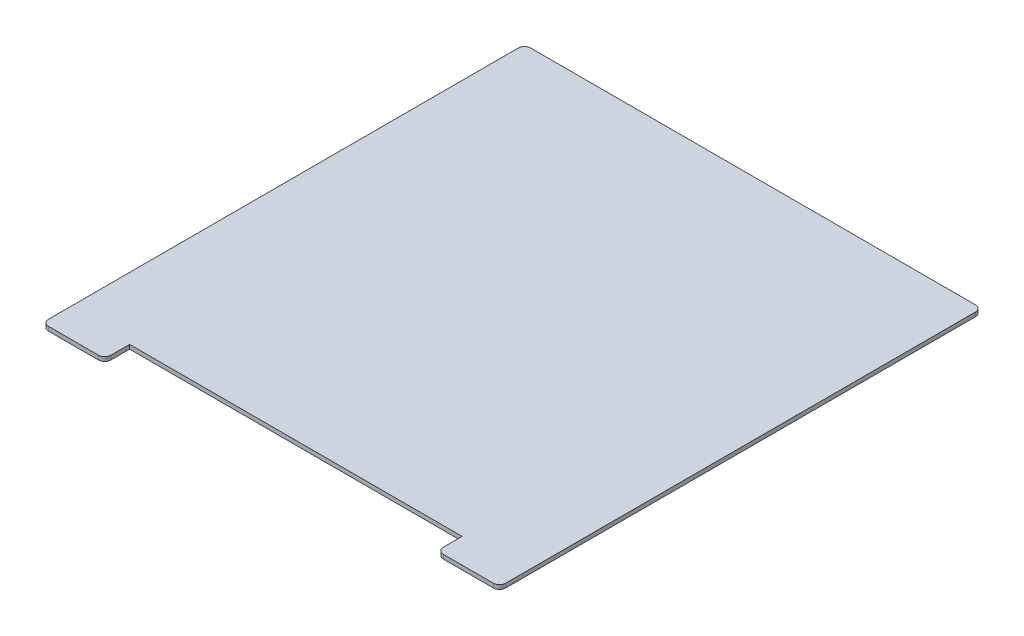
ISO-10303-21;
HEADER;
FILE_DESCRIPTION(('STEP AP214'),'2;1');
FILE_NAME('part.step','',(''),(''),'','','');
FILE_SCHEMA(('AUTOMOTIVE_DESIGN { 1 0 10303 214 1 1 1 1 }'));
ENDSEC;
DATA;
#1=APPLICATION_CONTEXT('core data for automotive mechanical design processes');
#2=APPLICATION_PROTOCOL_DEFINITION('international standard','automotive_design',2000,#1);
#3=PRODUCT_CONTEXT('',#1,'mechanical');
#4=PRODUCT('Part','Part','',(#3));
#5=PRODUCT_RELATED_PRODUCT_CATEGORY('part','',(#4));
#6=PRODUCT_DEFINITION_FORMATION('','',#4);
#7=PRODUCT_DEFINITION_CONTEXT('part definition',#1,'design');
#8=PRODUCT_DEFINITION('design','',#6,#7);
#9=PRODUCT_DEFINITION_SHAPE('','',#8);
#10=(LENGTH_UNIT() NAMED_UNIT(*) SI_UNIT(.MILLI.,.METRE.));
#11=(NAMED_UNIT(*) PLANE_ANGLE_UNIT() SI_UNIT($,.RADIAN.));
#12=(NAMED_UNIT(*) SI_UNIT($,.STERADIAN.) SOLID_ANGLE_UNIT());
#13=UNCERTAINTY_MEASURE_WITH_UNIT(LENGTH_MEASURE(1.E-05),#10,'distance_accuracy_value','');
#14=(GEOMETRIC_REPRESENTATION_CONTEXT(3) GLOBAL_UNCERTAINTY_ASSIGNED_CONTEXT((#13)) GLOBAL_UNIT_ASSIGNED_CONTEXT((#10,
#11,#12)) REPRESENTATION_CONTEXT('',''));
#15=CARTESIAN_POINT('',(0.,0.,0.));
#16=DIRECTION('',(0.,0.,1.));
#17=DIRECTION('',(1.,0.,0.));
#18=AXIS2_PLACEMENT_3D('',#15,#16,#17);
#19=CARTESIAN_POINT('',(-190.,2.,-34.3502538071066));
#20=DIRECTION('',(1.,0.,0.));
#21=DIRECTION('',(0.,0.,-1.));
#22=AXIS2_PLACEMENT_3D('',#19,#20,#21);
#23=PLANE('',#22);
#24=DIRECTION('',(0.,0.,1.));
#25=VECTOR('',#24,1.);
#26=CARTESIAN_POINT('',(-190.,2.,-34.3502538071066));
#27=LINE('',#26,#25);
#28=CARTESIAN_POINT('',(-190.,2.,-31.3502538071066));
#29=VERTEX_POINT('',#28);
#30=CARTESIAN_POINT('',(-190.,2.,194.649746192893));
#31=VERTEX_POINT('',#30);
#32=EDGE_CURVE('E192',#29,#31,#27,.T.);
#33=ORIENTED_EDGE('',*,*,#32,.F.);
#34=DIRECTION('',(0.,-1.,0.));
#35=VECTOR('',#34,1.);
#36=CARTESIAN_POINT('',(-190.,2.,-31.3502538071066));
#37=LINE('',#36,#35);
#38=CARTESIAN_POINT('',(-190.,0.,-31.3502538071066));
#39=VERTEX_POINT('',#38);
#40=EDGE_CURVE('E227',#29,#39,#37,.T.);
#41=ORIENTED_EDGE('',*,*,#40,.T.);
#42=DIRECTION('',(0.,0.,1.));
#43=VECTOR('',#42,1.);
#44=CARTESIAN_POINT('',(-190.,0.,-34.3502538071066));
#45=LINE('',#44,#43);
#46=CARTESIAN_POINT('',(-190.,0.,194.649746192893));
#47=VERTEX_POINT('',#46);
#48=EDGE_CURVE('E172',#39,#47,#45,.T.);
#49=ORIENTED_EDGE('',*,*,#48,.T.);
#50=DIRECTION('',(0.,-1.,0.));
#51=VECTOR('',#50,1.);
#52=CARTESIAN_POINT('',(-190.,2.,194.649746192893));
#53=LINE('',#52,#51);
#54=EDGE_CURVE('E225',#47,#31,#53,.F.);
#55=ORIENTED_EDGE('',*,*,#54,.T.);
#56=EDGE_LOOP('',(#33,#41,#49,#55));
#57=FACE_BOUND('',#56,.T.);
#58=ADVANCED_FACE('F33',(#57),#23,.F.);
#59=CARTESIAN_POINT('',(-190.,2.,197.649746192893));
#60=DIRECTION('',(0.,0.,-1.));
#61=DIRECTION('',(-1.,0.,0.));
#62=AXIS2_PLACEMENT_3D('',#59,#60,#61);
#63=PLANE('',#62);
#64=DIRECTION('',(1.,0.,0.));
#65=VECTOR('',#64,1.);
#66=CARTESIAN_POINT('',(-190.,0.,197.649746192893));
#67=LINE('',#66,#65);
#68=CARTESIAN_POINT('',(-187.,0.,197.649746192893));
#69=VERTEX_POINT('',#68);
#70=CARTESIAN_POINT('',(-163.,0.,197.649746192893));
#71=VERTEX_POINT('',#70);
#72=EDGE_CURVE('E175',#69,#71,#67,.T.);
#73=ORIENTED_EDGE('',*,*,#72,.T.);
#74=DIRECTION('',(0.,-1.,0.));
#75=VECTOR('',#74,1.);
#76=CARTESIAN_POINT('',(-163.,2.,197.649746192893));
#77=LINE('',#76,#75);
#78=CARTESIAN_POINT('',(-163.,2.,197.649746192893));
#79=VERTEX_POINT('',#78);
#80=EDGE_CURVE('E235',#71,#79,#77,.F.);
#81=ORIENTED_EDGE('',*,*,#80,.T.);
#82=DIRECTION('',(1.,0.,0.));
#83=VECTOR('',#82,1.);
#84=CARTESIAN_POINT('',(-190.,2.,197.649746192893));
#85=LINE('',#84,#83);
#86=CARTESIAN_POINT('',(-187.,2.,197.649746192893));
#87=VERTEX_POINT('',#86);
#88=EDGE_CURVE('E145',#87,#79,#85,.T.);
#89=ORIENTED_EDGE('',*,*,#88,.F.);
#90=DIRECTION('',(0.,-1.,0.));
#91=VECTOR('',#90,1.);
#92=CARTESIAN_POINT('',(-187.,2.,197.649746192893));
#93=LINE('',#92,#91);
#94=EDGE_CURVE('E232',#87,#69,#93,.T.);
#95=ORIENTED_EDGE('',*,*,#94,.T.);
#96=EDGE_LOOP('',(#73,#81,#89,#95));
#97=FACE_BOUND('',#96,.T.);
#98=ADVANCED_FACE('F291',(#97),#63,.F.);
#99=CARTESIAN_POINT('',(-160.,2.,197.649746192893));
#100=DIRECTION('',(-1.,0.,0.));
#101=DIRECTION('',(0.,0.,1.));
#102=AXIS2_PLACEMENT_3D('',#99,#100,#101);
#103=PLANE('',#102);
#104=DIRECTION('',(0.,0.,-1.));
#105=VECTOR('',#104,1.);
#106=CARTESIAN_POINT('',(-160.,2.,197.649746192893));
#107=LINE('',#106,#105);
#108=CARTESIAN_POINT('',(-160.,2.,194.649746192893));
#109=VERTEX_POINT('',#108);
#110=CARTESIAN_POINT('',(-160.,2.,185.649746192893));
#111=VERTEX_POINT('',#110);
#112=EDGE_CURVE('E132',#109,#111,#107,.T.);
#113=ORIENTED_EDGE('',*,*,#112,.F.);
#114=DIRECTION('',(0.,-1.,0.));
#115=VECTOR('',#114,1.);
#116=CARTESIAN_POINT('',(-160.,2.,194.649746192893));
#117=LINE('',#116,#115);
#118=CARTESIAN_POINT('',(-160.,0.,194.649746192893));
#119=VERTEX_POINT('',#118);
#120=EDGE_CURVE('E230',#109,#119,#117,.T.);
#121=ORIENTED_EDGE('',*,*,#120,.T.);
#122=DIRECTION('',(0.,0.,-1.));
#123=VECTOR('',#122,1.);
#124=CARTESIAN_POINT('',(-160.,0.,197.649746192893));
#125=LINE('',#124,#123);
#126=CARTESIAN_POINT('',(-160.,0.,185.649746192893));
#127=VERTEX_POINT('',#126);
#128=EDGE_CURVE('E151',#119,#127,#125,.T.);
#129=ORIENTED_EDGE('',*,*,#128,.T.);
#130=DIRECTION('',(0.,-1.,0.));
#131=VECTOR('',#130,1.);
#132=CARTESIAN_POINT('',(-160.,2.,185.649746192893));
#133=LINE('',#132,#131);
#134=EDGE_CURVE('E148',#111,#127,#133,.T.);
#135=ORIENTED_EDGE('',*,*,#134,.F.);
#136=EDGE_LOOP('',(#113,#121,#129,#135));
#137=FACE_BOUND('',#136,.T.);
#138=ADVANCED_FACE('F149',(#137),#103,.F.);
#139=CARTESIAN_POINT('',(-160.,2.,185.649746192893));
#140=DIRECTION('',(0.,0.,-1.));
#141=DIRECTION('',(-1.,0.,0.));
#142=AXIS2_PLACEMENT_3D('',#139,#140,#141);
#143=PLANE('',#142);
#144=DIRECTION('',(1.,0.,0.));
#145=VECTOR('',#144,1.);
#146=CARTESIAN_POINT('',(-160.,0.,185.649746192893));
#147=LINE('',#146,#145);
#148=CARTESIAN_POINT('',(0.,0.,185.649746192893));
#149=VERTEX_POINT('',#148);
#150=EDGE_CURVE('E179',#127,#149,#147,.T.);
#151=ORIENTED_EDGE('',*,*,#150,.T.);
#152=DIRECTION('',(0.,-1.,0.));
#153=VECTOR('',#152,1.);
#154=CARTESIAN_POINT('',(0.,2.,185.649746192893));
#155=LINE('',#154,#153);
#156=CARTESIAN_POINT('',(0.,2.,185.649746192893));
#157=VERTEX_POINT('',#156);
#158=EDGE_CURVE('E155',#157,#149,#155,.T.);
#159=ORIENTED_EDGE('',*,*,#158,.F.);
#160=DIRECTION('',(1.,0.,0.));
#161=VECTOR('',#160,1.);
#162=CARTESIAN_POINT('',(-160.,2.,185.649746192893));
#163=LINE('',#162,#161);
#164=EDGE_CURVE('E137',#111,#157,#163,.T.);
#165=ORIENTED_EDGE('',*,*,#164,.F.);
#166=ORIENTED_EDGE('',*,*,#134,.T.);
#167=EDGE_LOOP('',(#151,#159,#165,#166));
#168=FACE_BOUND('',#167,.T.);
#169=ADVANCED_FACE('F157',(#168),#143,.F.);
#170=CARTESIAN_POINT('',(0.,2.,185.649746192893));
#171=DIRECTION('',(1.,0.,0.));
#172=DIRECTION('',(0.,0.,-1.));
#173=AXIS2_PLACEMENT_3D('',#170,#171,#172);
#174=PLANE('',#173);
#175=DIRECTION('',(0.,0.,1.));
#176=VECTOR('',#175,1.);
#177=CARTESIAN_POINT('',(0.,0.,185.649746192893));
#178=LINE('',#177,#176);
#179=CARTESIAN_POINT('',(0.,0.,194.649746192893));
#180=VERTEX_POINT('',#179);
#181=EDGE_CURVE('E181',#149,#180,#178,.T.);
#182=ORIENTED_EDGE('',*,*,#181,.T.);
#183=DIRECTION('',(0.,-1.,0.));
#184=VECTOR('',#183,1.);
#185=CARTESIAN_POINT('',(0.,2.,194.649746192893));
#186=LINE('',#185,#184);
#187=CARTESIAN_POINT('',(0.,2.,194.649746192893));
#188=VERTEX_POINT('',#187);
#189=EDGE_CURVE('E11',#180,#188,#186,.F.);
#190=ORIENTED_EDGE('',*,*,#189,.T.);
#191=DIRECTION('',(0.,0.,1.));
#192=VECTOR('',#191,1.);
#193=CARTESIAN_POINT('',(0.,2.,185.649746192893));
#194=LINE('',#193,#192);
#195=EDGE_CURVE('E160',#157,#188,#194,.T.);
#196=ORIENTED_EDGE('',*,*,#195,.F.);
#197=ORIENTED_EDGE('',*,*,#158,.T.);
#198=EDGE_LOOP('',(#182,#190,#196,#197));
#199=FACE_BOUND('',#198,.T.);
#200=ADVANCED_FACE('F283',(#199),#174,.F.);
#201=CARTESIAN_POINT('',(0.,2.,197.649746192893));
#202=DIRECTION('',(0.,0.,-1.));
#203=DIRECTION('',(-1.,0.,0.));
#204=AXIS2_PLACEMENT_3D('',#201,#202,#203);
#205=PLANE('',#204);
#206=DIRECTION('',(1.,0.,0.));
#207=VECTOR('',#206,1.);
#208=CARTESIAN_POINT('',(0.,0.,197.649746192893));
#209=LINE('',#208,#207);
#210=CARTESIAN_POINT('',(3.,0.,197.649746192893));
#211=VERTEX_POINT('',#210);
#212=CARTESIAN_POINT('',(27.,0.,197.649746192893));
#213=VERTEX_POINT('',#212);
#214=EDGE_CURVE('E184',#211,#213,#209,.T.);
#215=ORIENTED_EDGE('',*,*,#214,.T.);
#216=DIRECTION('',(0.,-1.,0.));
#217=VECTOR('',#216,1.);
#218=CARTESIAN_POINT('',(27.,2.,197.649746192893));
#219=LINE('',#218,#217);
#220=CARTESIAN_POINT('',(27.,2.,197.649746192893));
#221=VERTEX_POINT('',#220);
#222=EDGE_CURVE('E41',#213,#221,#219,.F.);
#223=ORIENTED_EDGE('',*,*,#222,.T.);
#224=DIRECTION('',(1.,0.,0.));
#225=VECTOR('',#224,1.);
#226=CARTESIAN_POINT('',(0.,2.,197.649746192893));
#227=LINE('',#226,#225);
#228=CARTESIAN_POINT('',(3.,2.,197.649746192893));
#229=VERTEX_POINT('',#228);
#230=EDGE_CURVE('E162',#229,#221,#227,.T.);
#231=ORIENTED_EDGE('',*,*,#230,.F.);
#232=DIRECTION('',(0.,-1.,0.));
#233=VECTOR('',#232,1.);
#234=CARTESIAN_POINT('',(3.,2.,197.649746192893));
#235=LINE('',#234,#233);
#236=EDGE_CURVE('E237',#229,#211,#235,.T.);
#237=ORIENTED_EDGE('',*,*,#236,.T.);
#238=EDGE_LOOP('',(#215,#223,#231,#237));
#239=FACE_BOUND('',#238,.T.);
#240=ADVANCED_FACE('F241',(#239),#205,.F.);
#241=CARTESIAN_POINT('',(29.9999999999999,2.,-34.3502538071066));
#242=DIRECTION('',(-1.,0.,0.));
#243=DIRECTION('',(0.,0.,1.));
#244=AXIS2_PLACEMENT_3D('',#241,#242,#243);
#245=PLANE('',#244);
#246=DIRECTION('',(0.,0.,-1.));
#247=VECTOR('',#246,1.);
#248=CARTESIAN_POINT('',(29.9999999999999,0.,-34.3502538071066));
#249=LINE('',#248,#247);
#250=CARTESIAN_POINT('',(30.,0.,194.649746192893));
#251=VERTEX_POINT('',#250);
#252=CARTESIAN_POINT('',(29.9999999999999,0.,-31.3502538071066));
#253=VERTEX_POINT('',#252);
#254=EDGE_CURVE('E186',#251,#253,#249,.T.);
#255=ORIENTED_EDGE('',*,*,#254,.T.);
#256=DIRECTION('',(0.,-1.,0.));
#257=VECTOR('',#256,1.);
#258=CARTESIAN_POINT('',(29.9999999999999,2.,-31.3502538071066));
#259=LINE('',#258,#257);
#260=CARTESIAN_POINT('',(29.9999999999999,2.,-31.3502538071066));
#261=VERTEX_POINT('',#260);
#262=EDGE_CURVE('E213',#253,#261,#259,.F.);
#263=ORIENTED_EDGE('',*,*,#262,.T.);
#264=DIRECTION('',(0.,0.,-1.));
#265=VECTOR('',#264,1.);
#266=CARTESIAN_POINT('',(29.9999999999999,2.,-34.3502538071066));
#267=LINE('',#266,#265);
#268=CARTESIAN_POINT('',(30.,2.,194.649746192893));
#269=VERTEX_POINT('',#268);
#270=EDGE_CURVE('E167',#269,#261,#267,.T.);
#271=ORIENTED_EDGE('',*,*,#270,.F.);
#272=DIRECTION('',(0.,-1.,0.));
#273=VECTOR('',#272,1.);
#274=CARTESIAN_POINT('',(30.,2.,194.649746192893));
#275=LINE('',#274,#273);
#276=EDGE_CURVE('E210',#269,#251,#275,.T.);
#277=ORIENTED_EDGE('',*,*,#276,.T.);
#278=EDGE_LOOP('',(#255,#263,#271,#277));
#279=FACE_BOUND('',#278,.T.);
#280=ADVANCED_FACE('F254',(#279),#245,.F.);
#281=CARTESIAN_POINT('',(-190.,2.,-34.3502538071066));
#282=DIRECTION('',(0.,0.,1.));
#283=DIRECTION('',(1.,0.,0.));
#284=AXIS2_PLACEMENT_3D('',#281,#282,#283);
#285=PLANE('',#284);
#286=DIRECTION('',(-1.,0.,0.));
#287=VECTOR('',#286,1.);
#288=CARTESIAN_POINT('',(-190.,2.,-34.3502538071066));
#289=LINE('',#288,#287);
#290=CARTESIAN_POINT('',(26.9999999999999,2.,-34.3502538071066));
#291=VERTEX_POINT('',#290);
#292=CARTESIAN_POINT('',(-187.,2.,-34.3502538071066));
#293=VERTEX_POINT('',#292);
#294=EDGE_CURVE('E169',#291,#293,#289,.T.);
#295=ORIENTED_EDGE('',*,*,#294,.F.);
#296=DIRECTION('',(0.,-1.,0.));
#297=VECTOR('',#296,1.);
#298=CARTESIAN_POINT('',(26.9999999999999,2.,-34.3502538071066));
#299=LINE('',#298,#297);
#300=CARTESIAN_POINT('',(26.9999999999999,0.,-34.3502538071066));
#301=VERTEX_POINT('',#300);
#302=EDGE_CURVE('E195',#291,#301,#299,.T.);
#303=ORIENTED_EDGE('',*,*,#302,.T.);
#304=DIRECTION('',(-1.,0.,0.));
#305=VECTOR('',#304,1.);
#306=CARTESIAN_POINT('',(-190.,0.,-34.3502538071066));
#307=LINE('',#306,#305);
#308=CARTESIAN_POINT('',(-187.,0.,-34.3502538071066));
#309=VERTEX_POINT('',#308);
#310=EDGE_CURVE('E189',#301,#309,#307,.T.);
#311=ORIENTED_EDGE('',*,*,#310,.T.);
#312=DIRECTION('',(0.,-1.,0.));
#313=VECTOR('',#312,1.);
#314=CARTESIAN_POINT('',(-187.,2.,-34.3502538071066));
#315=LINE('',#314,#313);
#316=EDGE_CURVE('E154',#309,#293,#315,.F.);
#317=ORIENTED_EDGE('',*,*,#316,.T.);
#318=EDGE_LOOP('',(#295,#303,#311,#317));
#319=FACE_BOUND('',#318,.T.);
#320=ADVANCED_FACE('F262',(#319),#285,.F.);
#321=CARTESIAN_POINT('',(0.,2.,0.));
#322=DIRECTION('',(0.,1.,0.));
#323=DIRECTION('',(0.,0.,1.));
#324=AXIS2_PLACEMENT_3D('',#321,#322,#323);
#325=PLANE('',#324);
#326=ORIENTED_EDGE('',*,*,#270,.T.);
#327=CARTESIAN_POINT('',(26.9999999999999,2.,-31.3502538071066));
#328=DIRECTION('',(0.,1.,0.));
#329=DIRECTION('',(0.,0.,1.));
#330=AXIS2_PLACEMENT_3D('',#327,#328,#329);
#331=CIRCLE('',#330,3.);
#332=EDGE_CURVE('E223',#261,#291,#331,.T.);
#333=ORIENTED_EDGE('',*,*,#332,.T.);
#334=ORIENTED_EDGE('',*,*,#294,.T.);
#335=CARTESIAN_POINT('',(-187.,2.,-31.3502538071066));
#336=DIRECTION('',(0.,1.,0.));
#337=DIRECTION('',(0.,0.,1.));
#338=AXIS2_PLACEMENT_3D('',#335,#336,#337);
#339=CIRCLE('',#338,3.);
#340=EDGE_CURVE('E221',#293,#29,#339,.T.);
#341=ORIENTED_EDGE('',*,*,#340,.T.);
#342=ORIENTED_EDGE('',*,*,#32,.T.);
#343=CARTESIAN_POINT('',(-187.,2.,194.649746192893));
#344=DIRECTION('',(0.,1.,0.));
#345=DIRECTION('',(0.,0.,1.));
#346=AXIS2_PLACEMENT_3D('',#343,#344,#345);
#347=CIRCLE('',#346,3.);
#348=EDGE_CURVE('E218',#31,#87,#347,.T.);
#349=ORIENTED_EDGE('',*,*,#348,.T.);
#350=ORIENTED_EDGE('',*,*,#88,.T.);
#351=CARTESIAN_POINT('',(-163.,2.,194.649746192893));
#352=DIRECTION('',(0.,1.,0.));
#353=DIRECTION('',(0.,0.,1.));
#354=AXIS2_PLACEMENT_3D('',#351,#352,#353);
#355=CIRCLE('',#354,3.);
#356=EDGE_CURVE('E141',#79,#109,#355,.T.);
#357=ORIENTED_EDGE('',*,*,#356,.T.);
#358=ORIENTED_EDGE('',*,*,#112,.T.);
#359=ORIENTED_EDGE('',*,*,#164,.T.);
#360=ORIENTED_EDGE('',*,*,#195,.T.);
#361=CARTESIAN_POINT('',(3.,2.,194.649746192893));
#362=DIRECTION('',(0.,1.,0.));
#363=DIRECTION('',(0.,0.,1.));
#364=AXIS2_PLACEMENT_3D('',#361,#362,#363);
#365=CIRCLE('',#364,3.);
#366=EDGE_CURVE('E54',#188,#229,#365,.T.);
#367=ORIENTED_EDGE('',*,*,#366,.T.);
#368=ORIENTED_EDGE('',*,*,#230,.T.);
#369=CARTESIAN_POINT('',(27.,2.,194.649746192893));
#370=DIRECTION('',(0.,1.,0.));
#371=DIRECTION('',(0.,0.,1.));
#372=AXIS2_PLACEMENT_3D('',#369,#370,#371);
#373=CIRCLE('',#372,3.);
#374=EDGE_CURVE('E216',#221,#269,#373,.T.);
#375=ORIENTED_EDGE('',*,*,#374,.T.);
#376=EDGE_LOOP('',(#326,#333,#334,#341,#342,#349,#350,#357,#358,#359,#360,#367,#368,#375));
#377=FACE_BOUND('',#376,.T.);
#378=ADVANCED_FACE('F135',(#377),#325,.T.);
#379=CARTESIAN_POINT('',(0.,0.,0.));
#380=DIRECTION('',(0.,1.,0.));
#381=DIRECTION('',(0.,0.,1.));
#382=AXIS2_PLACEMENT_3D('',#379,#380,#381);
#383=PLANE('',#382);
#384=ORIENTED_EDGE('',*,*,#310,.F.);
#385=CARTESIAN_POINT('',(26.9999999999999,0.,-31.3502538071066));
#386=DIRECTION('',(0.,1.,0.));
#387=DIRECTION('',(0.,0.,1.));
#388=AXIS2_PLACEMENT_3D('',#385,#386,#387);
#389=CIRCLE('',#388,3.);
#390=EDGE_CURVE('E208',#301,#253,#389,.F.);
#391=ORIENTED_EDGE('',*,*,#390,.T.);
#392=ORIENTED_EDGE('',*,*,#254,.F.);
#393=CARTESIAN_POINT('',(27.,0.,194.649746192893));
#394=DIRECTION('',(0.,1.,0.));
#395=DIRECTION('',(0.,0.,1.));
#396=AXIS2_PLACEMENT_3D('',#393,#394,#395);
#397=CIRCLE('',#396,3.);
#398=EDGE_CURVE('E200',#251,#213,#397,.F.);
#399=ORIENTED_EDGE('',*,*,#398,.T.);
#400=ORIENTED_EDGE('',*,*,#214,.F.);
#401=CARTESIAN_POINT('',(3.,0.,194.649746192893));
#402=DIRECTION('',(0.,1.,0.));
#403=DIRECTION('',(0.,0.,1.));
#404=AXIS2_PLACEMENT_3D('',#401,#402,#403);
#405=CIRCLE('',#404,3.);
#406=EDGE_CURVE('E198',#211,#180,#405,.F.);
#407=ORIENTED_EDGE('',*,*,#406,.T.);
#408=ORIENTED_EDGE('',*,*,#181,.F.);
#409=ORIENTED_EDGE('',*,*,#150,.F.);
#410=ORIENTED_EDGE('',*,*,#128,.F.);
#411=CARTESIAN_POINT('',(-163.,0.,194.649746192893));
#412=DIRECTION('',(0.,1.,0.));
#413=DIRECTION('',(0.,0.,1.));
#414=AXIS2_PLACEMENT_3D('',#411,#412,#413);
#415=CIRCLE('',#414,3.);
#416=EDGE_CURVE('E204',#119,#71,#415,.F.);
#417=ORIENTED_EDGE('',*,*,#416,.T.);
#418=ORIENTED_EDGE('',*,*,#72,.F.);
#419=CARTESIAN_POINT('',(-187.,0.,194.649746192893));
#420=DIRECTION('',(0.,1.,0.));
#421=DIRECTION('',(0.,0.,1.));
#422=AXIS2_PLACEMENT_3D('',#419,#420,#421);
#423=CIRCLE('',#422,3.);
#424=EDGE_CURVE('E202',#69,#47,#423,.F.);
#425=ORIENTED_EDGE('',*,*,#424,.T.);
#426=ORIENTED_EDGE('',*,*,#48,.F.);
#427=CARTESIAN_POINT('',(-187.,0.,-31.3502538071066));
#428=DIRECTION('',(0.,1.,0.));
#429=DIRECTION('',(0.,0.,1.));
#430=AXIS2_PLACEMENT_3D('',#427,#428,#429);
#431=CIRCLE('',#430,3.);
#432=EDGE_CURVE('E206',#39,#309,#431,.F.);
#433=ORIENTED_EDGE('',*,*,#432,.T.);
#434=EDGE_LOOP('',(#384,#391,#392,#399,#400,#407,#408,#409,#410,#417,#418,#425,#426,#433));
#435=FACE_BOUND('',#434,.T.);
#436=ADVANCED_FACE('F245',(#435),#383,.F.);
#437=CARTESIAN_POINT('',(26.9999999999999,2.,-31.3502538071066));
#438=DIRECTION('',(0.,-1.,0.));
#439=DIRECTION('',(0.,0.,-1.));
#440=AXIS2_PLACEMENT_3D('',#437,#438,#439);
#441=CYLINDRICAL_SURFACE('',#440,3.);
#442=ORIENTED_EDGE('',*,*,#332,.F.);
#443=ORIENTED_EDGE('',*,*,#262,.F.);
#444=ORIENTED_EDGE('',*,*,#390,.F.);
#445=ORIENTED_EDGE('',*,*,#302,.F.);
#446=EDGE_LOOP('',(#442,#443,#444,#445));
#447=FACE_BOUND('',#446,.T.);
#448=ADVANCED_FACE('F260',(#447),#441,.T.);
#449=CARTESIAN_POINT('',(-187.,2.,-31.3502538071066));
#450=DIRECTION('',(0.,-1.,0.));
#451=DIRECTION('',(0.,0.,-1.));
#452=AXIS2_PLACEMENT_3D('',#449,#450,#451);
#453=CYLINDRICAL_SURFACE('',#452,3.);
#454=ORIENTED_EDGE('',*,*,#340,.F.);
#455=ORIENTED_EDGE('',*,*,#316,.F.);
#456=ORIENTED_EDGE('',*,*,#432,.F.);
#457=ORIENTED_EDGE('',*,*,#40,.F.);
#458=EDGE_LOOP('',(#454,#455,#456,#457));
#459=FACE_BOUND('',#458,.T.);
#460=ADVANCED_FACE('F268',(#459),#453,.T.);
#461=CARTESIAN_POINT('',(-163.,2.,194.649746192893));
#462=DIRECTION('',(0.,-1.,0.));
#463=DIRECTION('',(0.,0.,-1.));
#464=AXIS2_PLACEMENT_3D('',#461,#462,#463);
#465=CYLINDRICAL_SURFACE('',#464,3.);
#466=ORIENTED_EDGE('',*,*,#356,.F.);
#467=ORIENTED_EDGE('',*,*,#80,.F.);
#468=ORIENTED_EDGE('',*,*,#416,.F.);
#469=ORIENTED_EDGE('',*,*,#120,.F.);
#470=EDGE_LOOP('',(#466,#467,#468,#469));
#471=FACE_BOUND('',#470,.T.);
#472=ADVANCED_FACE('F280',(#471),#465,.T.);
#473=CARTESIAN_POINT('',(-187.,2.,194.649746192893));
#474=DIRECTION('',(0.,-1.,0.));
#475=DIRECTION('',(0.,0.,-1.));
#476=AXIS2_PLACEMENT_3D('',#473,#474,#475);
#477=CYLINDRICAL_SURFACE('',#476,3.);
#478=ORIENTED_EDGE('',*,*,#348,.F.);
#479=ORIENTED_EDGE('',*,*,#54,.F.);
#480=ORIENTED_EDGE('',*,*,#424,.F.);
#481=ORIENTED_EDGE('',*,*,#94,.F.);
#482=EDGE_LOOP('',(#478,#479,#480,#481));
#483=FACE_BOUND('',#482,.T.);
#484=ADVANCED_FACE('F289',(#483),#477,.T.);
#485=CARTESIAN_POINT('',(27.,2.,194.649746192893));
#486=DIRECTION('',(0.,-1.,0.));
#487=DIRECTION('',(0.,0.,-1.));
#488=AXIS2_PLACEMENT_3D('',#485,#486,#487);
#489=CYLINDRICAL_SURFACE('',#488,3.);
#490=ORIENTED_EDGE('',*,*,#374,.F.);
#491=ORIENTED_EDGE('',*,*,#222,.F.);
#492=ORIENTED_EDGE('',*,*,#398,.F.);
#493=ORIENTED_EDGE('',*,*,#276,.F.);
#494=EDGE_LOOP('',(#490,#491,#492,#493));
#495=FACE_BOUND('',#494,.T.);
#496=ADVANCED_FACE('F251',(#495),#489,.T.);
#497=CARTESIAN_POINT('',(3.,2.,194.649746192893));
#498=DIRECTION('',(0.,-1.,0.));
#499=DIRECTION('',(0.,0.,-1.));
#500=AXIS2_PLACEMENT_3D('',#497,#498,#499);
#501=CYLINDRICAL_SURFACE('',#500,3.);
#502=ORIENTED_EDGE('',*,*,#366,.F.);
#503=ORIENTED_EDGE('',*,*,#189,.F.);
#504=ORIENTED_EDGE('',*,*,#406,.F.);
#505=ORIENTED_EDGE('',*,*,#236,.F.);
#506=EDGE_LOOP('',(#502,#503,#504,#505));
#507=FACE_BOUND('',#506,.T.);
#508=ADVANCED_FACE('F35',(#507),#501,.T.);
#509=CLOSED_SHELL('',(#58,#98,#138,#169,#200,#240,#280,#320,#378,#436,#448,#460,#472,#484,#496,#508));
#510=MANIFOLD_SOLID_BREP('B2',#509);
#511=ADVANCED_BREP_SHAPE_REPRESENTATION('',(#18,#510),#14);
#512=SHAPE_DEFINITION_REPRESENTATION(#9,#511);
ENDSEC;
END-ISO-10303-21;
